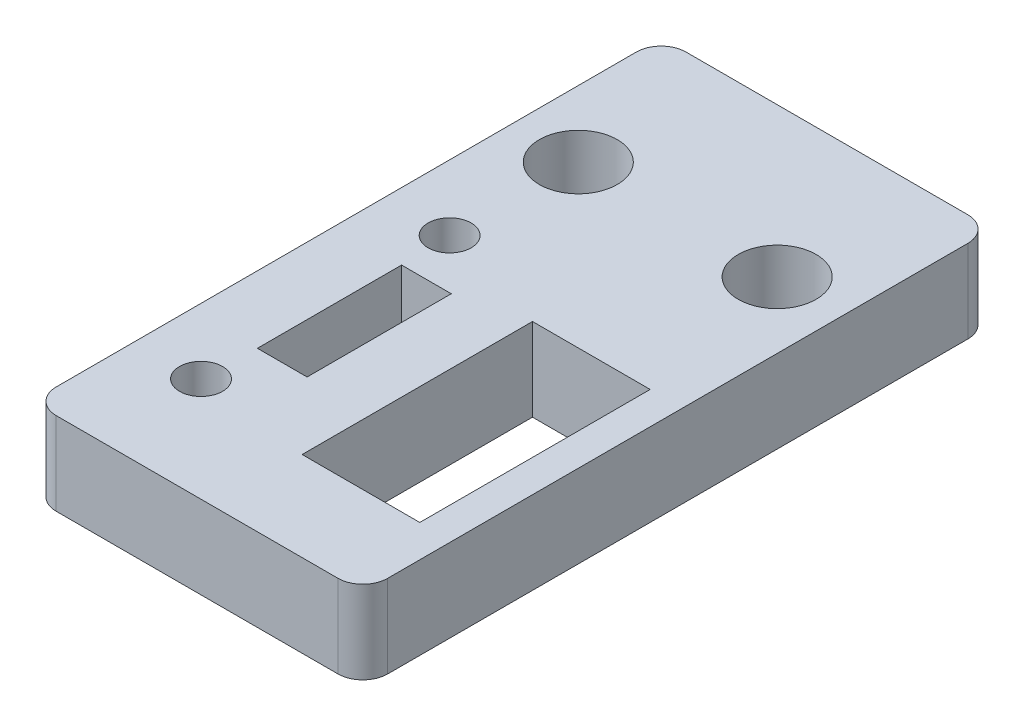
ISO-10303-21;
HEADER;
FILE_DESCRIPTION(('STEP AP214'),'2;1');
FILE_NAME('part.step','',(''),(''),'','','');
FILE_SCHEMA(('AUTOMOTIVE_DESIGN { 1 0 10303 214 1 1 1 1 }'));
ENDSEC;
DATA;
#1=APPLICATION_CONTEXT('core data for automotive mechanical design processes');
#2=APPLICATION_PROTOCOL_DEFINITION('international standard','automotive_design',2000,#1);
#3=PRODUCT_CONTEXT('',#1,'mechanical');
#4=PRODUCT('Part','Part','',(#3));
#5=PRODUCT_RELATED_PRODUCT_CATEGORY('part','',(#4));
#6=PRODUCT_DEFINITION_FORMATION('','',#4);
#7=PRODUCT_DEFINITION_CONTEXT('part definition',#1,'design');
#8=PRODUCT_DEFINITION('design','',#6,#7);
#9=PRODUCT_DEFINITION_SHAPE('','',#8);
#10=(LENGTH_UNIT() NAMED_UNIT(*) SI_UNIT(.MILLI.,.METRE.));
#11=(NAMED_UNIT(*) PLANE_ANGLE_UNIT() SI_UNIT($,.RADIAN.));
#12=(NAMED_UNIT(*) SI_UNIT($,.STERADIAN.) SOLID_ANGLE_UNIT());
#13=UNCERTAINTY_MEASURE_WITH_UNIT(LENGTH_MEASURE(1.E-05),#10,'distance_accuracy_value','');
#14=(GEOMETRIC_REPRESENTATION_CONTEXT(3) GLOBAL_UNCERTAINTY_ASSIGNED_CONTEXT((#13)) GLOBAL_UNIT_ASSIGNED_CONTEXT((#10,
#11,#12)) REPRESENTATION_CONTEXT('',''));
#15=CARTESIAN_POINT('',(0.,0.,0.));
#16=DIRECTION('',(0.,0.,1.));
#17=DIRECTION('',(1.,0.,0.));
#18=AXIS2_PLACEMENT_3D('',#15,#16,#17);
#19=CARTESIAN_POINT('',(-236.,67.49994211399,3.5));
#20=DIRECTION('',(0.,1.,0.));
#21=DIRECTION('',(0.,0.,1.));
#22=AXIS2_PLACEMENT_3D('',#19,#20,#21);
#23=PLANE('',#22);
#24=CARTESIAN_POINT('',(-230.,67.49994211399,-8.));
#25=DIRECTION('',(0.,1.,0.));
#26=DIRECTION('',(0.,0.,1.));
#27=AXIS2_PLACEMENT_3D('',#24,#25,#26);
#28=CIRCLE('',#27,2.35);
#29=CARTESIAN_POINT('',(-230.,67.49994211399,-5.65));
#30=VERTEX_POINT('',#29);
#31=EDGE_CURVE('E200',#30,#30,#28,.F.);
#32=ORIENTED_EDGE('',*,*,#31,.T.);
#33=EDGE_LOOP('',(#32));
#34=FACE_BOUND('',#33,.T.);
#35=CARTESIAN_POINT('',(-242.,67.49994211399,-8.));
#36=DIRECTION('',(0.,1.,0.));
#37=DIRECTION('',(0.,0.,1.));
#38=AXIS2_PLACEMENT_3D('',#35,#36,#37);
#39=CIRCLE('',#38,2.35);
#40=CARTESIAN_POINT('',(-242.,67.49994211399,-5.65));
#41=VERTEX_POINT('',#40);
#42=EDGE_CURVE('E196',#41,#41,#39,.F.);
#43=ORIENTED_EDGE('',*,*,#42,.T.);
#44=EDGE_LOOP('',(#43));
#45=FACE_BOUND('',#44,.T.);
#46=CARTESIAN_POINT('',(-227.5,67.49994211399,-15.5));
#47=DIRECTION('',(0.,-1.,0.));
#48=DIRECTION('',(0.,0.,-1.));
#49=AXIS2_PLACEMENT_3D('',#46,#47,#48);
#50=CIRCLE('',#49,1.5);
#51=CARTESIAN_POINT('',(-227.5,67.49994211399,-17.));
#52=VERTEX_POINT('',#51);
#53=CARTESIAN_POINT('',(-226.,67.49994211399,-15.5));
#54=VERTEX_POINT('',#53);
#55=EDGE_CURVE('E144',#52,#54,#50,.T.);
#56=ORIENTED_EDGE('',*,*,#55,.F.);
#57=DIRECTION('',(-1.,0.,0.));
#58=VECTOR('',#57,1.);
#59=CARTESIAN_POINT('',(-246.,67.49994211399,-17.));
#60=LINE('',#59,#58);
#61=CARTESIAN_POINT('',(-244.5,67.49994211399,-17.));
#62=VERTEX_POINT('',#61);
#63=EDGE_CURVE('E140',#62,#52,#60,.F.);
#64=ORIENTED_EDGE('',*,*,#63,.F.);
#65=CARTESIAN_POINT('',(-244.5,67.49994211399,-15.5));
#66=DIRECTION('',(0.,-1.,0.));
#67=DIRECTION('',(0.,0.,-1.));
#68=AXIS2_PLACEMENT_3D('',#65,#66,#67);
#69=CIRCLE('',#68,1.5);
#70=CARTESIAN_POINT('',(-246.,67.49994211399,-15.5));
#71=VERTEX_POINT('',#70);
#72=EDGE_CURVE('E19',#71,#62,#69,.T.);
#73=ORIENTED_EDGE('',*,*,#72,.F.);
#74=DIRECTION('',(0.,0.,1.));
#75=VECTOR('',#74,1.);
#76=CARTESIAN_POINT('',(-246.,67.49994211399,24.));
#77=LINE('',#76,#75);
#78=CARTESIAN_POINT('',(-246.,67.49994211399,19.5));
#79=VERTEX_POINT('',#78);
#80=EDGE_CURVE('E127',#79,#71,#77,.F.);
#81=ORIENTED_EDGE('',*,*,#80,.F.);
#82=CARTESIAN_POINT('',(-244.5,67.49994211399,19.5));
#83=DIRECTION('',(0.,-1.,0.));
#84=DIRECTION('',(0.,0.,-1.));
#85=AXIS2_PLACEMENT_3D('',#82,#83,#84);
#86=CIRCLE('',#85,1.5);
#87=CARTESIAN_POINT('',(-244.5,67.49994211399,21.));
#88=VERTEX_POINT('',#87);
#89=EDGE_CURVE('E207',#88,#79,#86,.T.);
#90=ORIENTED_EDGE('',*,*,#89,.F.);
#91=DIRECTION('',(1.,0.,0.));
#92=VECTOR('',#91,1.);
#93=CARTESIAN_POINT('',(-226.,67.49994211399,21.));
#94=LINE('',#93,#92);
#95=CARTESIAN_POINT('',(-227.5,67.49994211399,21.));
#96=VERTEX_POINT('',#95);
#97=EDGE_CURVE('E161',#96,#88,#94,.F.);
#98=ORIENTED_EDGE('',*,*,#97,.F.);
#99=CARTESIAN_POINT('',(-227.5,67.49994211399,19.5));
#100=DIRECTION('',(0.,-1.,0.));
#101=DIRECTION('',(0.,0.,-1.));
#102=AXIS2_PLACEMENT_3D('',#99,#100,#101);
#103=CIRCLE('',#102,1.5);
#104=CARTESIAN_POINT('',(-226.,67.49994211399,19.5));
#105=VERTEX_POINT('',#104);
#106=EDGE_CURVE('E206',#105,#96,#103,.T.);
#107=ORIENTED_EDGE('',*,*,#106,.F.);
#108=DIRECTION('',(0.,0.,-1.));
#109=VECTOR('',#108,1.);
#110=CARTESIAN_POINT('',(-226.,67.49994211399,-17.));
#111=LINE('',#110,#109);
#112=EDGE_CURVE('E157',#54,#105,#111,.F.);
#113=ORIENTED_EDGE('',*,*,#112,.F.);
#114=EDGE_LOOP('',(#56,#64,#73,#81,#90,#98,#107,#113));
#115=FACE_BOUND('',#114,.T.);
#116=CARTESIAN_POINT('',(-242.05,67.49994211399,14.7129502600828));
#117=DIRECTION('',(0.,1.,0.));
#118=DIRECTION('',(0.,0.,1.));
#119=AXIS2_PLACEMENT_3D('',#116,#117,#118);
#120=CIRCLE('',#119,1.3);
#121=CARTESIAN_POINT('',(-242.05,67.49994211399,16.0129502600828));
#122=VERTEX_POINT('',#121);
#123=EDGE_CURVE('E189',#122,#122,#120,.F.);
#124=ORIENTED_EDGE('',*,*,#123,.T.);
#125=EDGE_LOOP('',(#124));
#126=FACE_BOUND('',#125,.T.);
#127=CARTESIAN_POINT('',(-242.05,67.49994211399,-0.287049739917195));
#128=DIRECTION('',(0.,1.,0.));
#129=DIRECTION('',(0.,0.,1.));
#130=AXIS2_PLACEMENT_3D('',#127,#128,#129);
#131=CIRCLE('',#130,1.3);
#132=CARTESIAN_POINT('',(-242.05,67.49994211399,1.01295026008281));
#133=VERTEX_POINT('',#132);
#134=EDGE_CURVE('E192',#133,#133,#131,.F.);
#135=ORIENTED_EDGE('',*,*,#134,.T.);
#136=EDGE_LOOP('',(#135));
#137=FACE_BOUND('',#136,.T.);
#138=DIRECTION('',(0.,0.,-1.));
#139=VECTOR('',#138,1.);
#140=CARTESIAN_POINT('',(-238.95,67.49994211399,2.71295026008286));
#141=LINE('',#140,#139);
#142=CARTESIAN_POINT('',(-238.95,67.49994211399,2.71295026008286));
#143=VERTEX_POINT('',#142);
#144=CARTESIAN_POINT('',(-238.95,67.49994211399,11.4129502600829));
#145=VERTEX_POINT('',#144);
#146=EDGE_CURVE('E230',#143,#145,#141,.F.);
#147=ORIENTED_EDGE('',*,*,#146,.T.);
#148=DIRECTION('',(1.,0.,0.));
#149=VECTOR('',#148,1.);
#150=CARTESIAN_POINT('',(-238.95,67.49994211399,11.4129502600829));
#151=LINE('',#150,#149);
#152=CARTESIAN_POINT('',(-241.95,67.49994211399,11.4129502600829));
#153=VERTEX_POINT('',#152);
#154=EDGE_CURVE('E195',#145,#153,#151,.F.);
#155=ORIENTED_EDGE('',*,*,#154,.T.);
#156=DIRECTION('',(0.,0.,1.));
#157=VECTOR('',#156,1.);
#158=CARTESIAN_POINT('',(-241.95,67.49994211399,11.4129502600829));
#159=LINE('',#158,#157);
#160=CARTESIAN_POINT('',(-241.95,67.49994211399,2.71295026008286));
#161=VERTEX_POINT('',#160);
#162=EDGE_CURVE('E240',#153,#161,#159,.F.);
#163=ORIENTED_EDGE('',*,*,#162,.T.);
#164=DIRECTION('',(-1.,0.,0.));
#165=VECTOR('',#164,1.);
#166=CARTESIAN_POINT('',(-241.95,67.49994211399,2.71295026008286));
#167=LINE('',#166,#165);
#168=EDGE_CURVE('E235',#161,#143,#167,.F.);
#169=ORIENTED_EDGE('',*,*,#168,.T.);
#170=EDGE_LOOP('',(#147,#155,#163,#169));
#171=FACE_BOUND('',#170,.T.);
#172=DIRECTION('',(1.,0.,0.));
#173=VECTOR('',#172,1.);
#174=CARTESIAN_POINT('',(-229.95,67.49994211399,15.6129502600828));
#175=LINE('',#174,#173);
#176=CARTESIAN_POINT('',(-227.95,67.49994211399,15.6129502600828));
#177=VERTEX_POINT('',#176);
#178=CARTESIAN_POINT('',(-235.05,67.49994211399,15.6129502600828));
#179=VERTEX_POINT('',#178);
#180=EDGE_CURVE('E199',#177,#179,#175,.F.);
#181=ORIENTED_EDGE('',*,*,#180,.T.);
#182=DIRECTION('',(0.,0.,1.));
#183=VECTOR('',#182,1.);
#184=CARTESIAN_POINT('',(-235.05,67.49994211399,15.6129502600828));
#185=LINE('',#184,#183);
#186=CARTESIAN_POINT('',(-235.05,67.49994211399,1.71295026008287));
#187=VERTEX_POINT('',#186);
#188=EDGE_CURVE('E256',#179,#187,#185,.F.);
#189=ORIENTED_EDGE('',*,*,#188,.T.);
#190=DIRECTION('',(-1.,0.,0.));
#191=VECTOR('',#190,1.);
#192=CARTESIAN_POINT('',(-235.05,67.49994211399,1.71295026008287));
#193=LINE('',#192,#191);
#194=CARTESIAN_POINT('',(-227.95,67.49994211399,1.71295026008287));
#195=VERTEX_POINT('',#194);
#196=EDGE_CURVE('E251',#187,#195,#193,.F.);
#197=ORIENTED_EDGE('',*,*,#196,.T.);
#198=DIRECTION('',(0.,0.,-1.));
#199=VECTOR('',#198,1.);
#200=CARTESIAN_POINT('',(-227.95,67.49994211399,1.71295026008287));
#201=LINE('',#200,#199);
#202=EDGE_CURVE('E245',#195,#177,#201,.F.);
#203=ORIENTED_EDGE('',*,*,#202,.T.);
#204=EDGE_LOOP('',(#181,#189,#197,#203));
#205=FACE_BOUND('',#204,.T.);
#206=ADVANCED_FACE('F16',(#34,#45,#115,#126,#137,#171,#205),#23,.T.);
#207=CARTESIAN_POINT('',(-246.,62.49994211399,-17.));
#208=DIRECTION('',(0.,0.,-1.));
#209=DIRECTION('',(-1.,0.,0.));
#210=AXIS2_PLACEMENT_3D('',#207,#208,#209);
#211=PLANE('',#210);
#212=DIRECTION('',(0.,-1.,0.));
#213=VECTOR('',#212,1.);
#214=CARTESIAN_POINT('',(-227.5,74.01794211399,-17.));
#215=LINE('',#214,#213);
#216=CARTESIAN_POINT('',(-227.5,62.49994211399,-17.));
#217=VERTEX_POINT('',#216);
#218=EDGE_CURVE('E205',#217,#52,#215,.F.);
#219=ORIENTED_EDGE('',*,*,#218,.F.);
#220=DIRECTION('',(1.,0.,0.));
#221=VECTOR('',#220,1.);
#222=CARTESIAN_POINT('',(-236.,62.49994211399,-17.));
#223=LINE('',#222,#221);
#224=CARTESIAN_POINT('',(-244.5,62.49994211399,-17.));
#225=VERTEX_POINT('',#224);
#226=EDGE_CURVE('E151',#217,#225,#223,.F.);
#227=ORIENTED_EDGE('',*,*,#226,.T.);
#228=DIRECTION('',(0.,-1.,0.));
#229=VECTOR('',#228,1.);
#230=CARTESIAN_POINT('',(-244.5,74.01794211399,-17.));
#231=LINE('',#230,#229);
#232=EDGE_CURVE('E136',#62,#225,#231,.T.);
#233=ORIENTED_EDGE('',*,*,#232,.F.);
#234=ORIENTED_EDGE('',*,*,#63,.T.);
#235=EDGE_LOOP('',(#219,#227,#233,#234));
#236=FACE_BOUND('',#235,.T.);
#237=ADVANCED_FACE('F150',(#236),#211,.T.);
#238=CARTESIAN_POINT('',(-244.5,74.01794211399,-15.5));
#239=DIRECTION('',(0.,-1.,0.));
#240=DIRECTION('',(0.,0.,-1.));
#241=AXIS2_PLACEMENT_3D('',#238,#239,#240);
#242=CYLINDRICAL_SURFACE('',#241,1.5);
#243=ORIENTED_EDGE('',*,*,#72,.T.);
#244=ORIENTED_EDGE('',*,*,#232,.T.);
#245=CARTESIAN_POINT('',(-244.5,62.49994211399,-15.5));
#246=DIRECTION('',(0.,-1.,0.));
#247=DIRECTION('',(0.,0.,-1.));
#248=AXIS2_PLACEMENT_3D('',#245,#246,#247);
#249=CIRCLE('',#248,1.5);
#250=CARTESIAN_POINT('',(-246.,62.49994211399,-15.5));
#251=VERTEX_POINT('',#250);
#252=EDGE_CURVE('E187',#225,#251,#249,.F.);
#253=ORIENTED_EDGE('',*,*,#252,.T.);
#254=DIRECTION('',(0.,1.,0.));
#255=VECTOR('',#254,1.);
#256=CARTESIAN_POINT('',(-246.,62.49994211399,-15.5));
#257=LINE('',#256,#255);
#258=EDGE_CURVE('E138',#71,#251,#257,.F.);
#259=ORIENTED_EDGE('',*,*,#258,.F.);
#260=EDGE_LOOP('',(#243,#244,#253,#259));
#261=FACE_BOUND('',#260,.T.);
#262=ADVANCED_FACE('F133',(#261),#242,.T.);
#263=CARTESIAN_POINT('',(-246.,62.49994211399,24.));
#264=DIRECTION('',(-1.,0.,0.));
#265=DIRECTION('',(0.,0.,1.));
#266=AXIS2_PLACEMENT_3D('',#263,#264,#265);
#267=PLANE('',#266);
#268=ORIENTED_EDGE('',*,*,#80,.T.);
#269=ORIENTED_EDGE('',*,*,#258,.T.);
#270=DIRECTION('',(0.,0.,1.));
#271=VECTOR('',#270,1.);
#272=CARTESIAN_POINT('',(-246.,62.49994211399,3.5));
#273=LINE('',#272,#271);
#274=CARTESIAN_POINT('',(-246.,62.49994211399,19.5));
#275=VERTEX_POINT('',#274);
#276=EDGE_CURVE('E186',#251,#275,#273,.T.);
#277=ORIENTED_EDGE('',*,*,#276,.T.);
#278=DIRECTION('',(0.,-1.,0.));
#279=VECTOR('',#278,1.);
#280=CARTESIAN_POINT('',(-246.,74.01794211399,19.5));
#281=LINE('',#280,#279);
#282=EDGE_CURVE('E163',#79,#275,#281,.T.);
#283=ORIENTED_EDGE('',*,*,#282,.F.);
#284=EDGE_LOOP('',(#268,#269,#277,#283));
#285=FACE_BOUND('',#284,.T.);
#286=ADVANCED_FACE('F213',(#285),#267,.T.);
#287=CARTESIAN_POINT('',(-244.5,74.01794211399,19.5));
#288=DIRECTION('',(0.,-1.,0.));
#289=DIRECTION('',(0.,0.,-1.));
#290=AXIS2_PLACEMENT_3D('',#287,#288,#289);
#291=CYLINDRICAL_SURFACE('',#290,1.5);
#292=ORIENTED_EDGE('',*,*,#89,.T.);
#293=ORIENTED_EDGE('',*,*,#282,.T.);
#294=CARTESIAN_POINT('',(-244.5,62.49994211399,19.5));
#295=DIRECTION('',(0.,-1.,0.));
#296=DIRECTION('',(0.,0.,-1.));
#297=AXIS2_PLACEMENT_3D('',#294,#295,#296);
#298=CIRCLE('',#297,1.5);
#299=CARTESIAN_POINT('',(-244.5,62.49994211399,21.));
#300=VERTEX_POINT('',#299);
#301=EDGE_CURVE('E183',#275,#300,#298,.F.);
#302=ORIENTED_EDGE('',*,*,#301,.T.);
#303=DIRECTION('',(0.,1.,0.));
#304=VECTOR('',#303,1.);
#305=CARTESIAN_POINT('',(-244.5,62.49994211399,21.));
#306=LINE('',#305,#304);
#307=EDGE_CURVE('E162',#88,#300,#306,.F.);
#308=ORIENTED_EDGE('',*,*,#307,.F.);
#309=EDGE_LOOP('',(#292,#293,#302,#308));
#310=FACE_BOUND('',#309,.T.);
#311=ADVANCED_FACE('F272',(#310),#291,.T.);
#312=CARTESIAN_POINT('',(-226.,62.49994211399,21.));
#313=DIRECTION('',(0.,0.,1.));
#314=DIRECTION('',(1.,0.,0.));
#315=AXIS2_PLACEMENT_3D('',#312,#313,#314);
#316=PLANE('',#315);
#317=ORIENTED_EDGE('',*,*,#307,.T.);
#318=DIRECTION('',(1.,0.,0.));
#319=VECTOR('',#318,1.);
#320=CARTESIAN_POINT('',(-236.,62.49994211399,21.));
#321=LINE('',#320,#319);
#322=CARTESIAN_POINT('',(-227.5,62.49994211399,21.));
#323=VERTEX_POINT('',#322);
#324=EDGE_CURVE('E182',#300,#323,#321,.T.);
#325=ORIENTED_EDGE('',*,*,#324,.T.);
#326=DIRECTION('',(0.,-1.,0.));
#327=VECTOR('',#326,1.);
#328=CARTESIAN_POINT('',(-227.5,74.01794211399,21.));
#329=LINE('',#328,#327);
#330=EDGE_CURVE('E159',#96,#323,#329,.T.);
#331=ORIENTED_EDGE('',*,*,#330,.F.);
#332=ORIENTED_EDGE('',*,*,#97,.T.);
#333=EDGE_LOOP('',(#317,#325,#331,#332));
#334=FACE_BOUND('',#333,.T.);
#335=ADVANCED_FACE('F268',(#334),#316,.T.);
#336=CARTESIAN_POINT('',(-227.5,74.01794211399,19.5));
#337=DIRECTION('',(0.,-1.,0.));
#338=DIRECTION('',(0.,0.,-1.));
#339=AXIS2_PLACEMENT_3D('',#336,#337,#338);
#340=CYLINDRICAL_SURFACE('',#339,1.5);
#341=ORIENTED_EDGE('',*,*,#106,.T.);
#342=ORIENTED_EDGE('',*,*,#330,.T.);
#343=CARTESIAN_POINT('',(-227.5,62.49994211399,19.5));
#344=DIRECTION('',(0.,-1.,0.));
#345=DIRECTION('',(0.,0.,-1.));
#346=AXIS2_PLACEMENT_3D('',#343,#344,#345);
#347=CIRCLE('',#346,1.5);
#348=CARTESIAN_POINT('',(-226.,62.49994211399,19.5));
#349=VERTEX_POINT('',#348);
#350=EDGE_CURVE('E179',#323,#349,#347,.F.);
#351=ORIENTED_EDGE('',*,*,#350,.T.);
#352=DIRECTION('',(0.,1.,0.));
#353=VECTOR('',#352,1.);
#354=CARTESIAN_POINT('',(-226.,62.49994211399,19.5));
#355=LINE('',#354,#353);
#356=EDGE_CURVE('E158',#105,#349,#355,.F.);
#357=ORIENTED_EDGE('',*,*,#356,.F.);
#358=EDGE_LOOP('',(#341,#342,#351,#357));
#359=FACE_BOUND('',#358,.T.);
#360=ADVANCED_FACE('F280',(#359),#340,.T.);
#361=CARTESIAN_POINT('',(-226.,62.49994211399,-17.));
#362=DIRECTION('',(1.,0.,0.));
#363=DIRECTION('',(0.,0.,-1.));
#364=AXIS2_PLACEMENT_3D('',#361,#362,#363);
#365=PLANE('',#364);
#366=ORIENTED_EDGE('',*,*,#112,.T.);
#367=ORIENTED_EDGE('',*,*,#356,.T.);
#368=DIRECTION('',(0.,0.,1.));
#369=VECTOR('',#368,1.);
#370=CARTESIAN_POINT('',(-226.,62.49994211399,3.5));
#371=LINE('',#370,#369);
#372=CARTESIAN_POINT('',(-226.,62.49994211399,-15.5));
#373=VERTEX_POINT('',#372);
#374=EDGE_CURVE('E178',#349,#373,#371,.F.);
#375=ORIENTED_EDGE('',*,*,#374,.T.);
#376=DIRECTION('',(0.,-1.,0.));
#377=VECTOR('',#376,1.);
#378=CARTESIAN_POINT('',(-226.,74.01794211399,-15.5));
#379=LINE('',#378,#377);
#380=EDGE_CURVE('E203',#54,#373,#379,.T.);
#381=ORIENTED_EDGE('',*,*,#380,.F.);
#382=EDGE_LOOP('',(#366,#367,#375,#381));
#383=FACE_BOUND('',#382,.T.);
#384=ADVANCED_FACE('F341',(#383),#365,.T.);
#385=CARTESIAN_POINT('',(-227.5,74.01794211399,-15.5));
#386=DIRECTION('',(0.,-1.,0.));
#387=DIRECTION('',(0.,0.,-1.));
#388=AXIS2_PLACEMENT_3D('',#385,#386,#387);
#389=CYLINDRICAL_SURFACE('',#388,1.5);
#390=ORIENTED_EDGE('',*,*,#55,.T.);
#391=ORIENTED_EDGE('',*,*,#380,.T.);
#392=CARTESIAN_POINT('',(-227.5,62.49994211399,-15.5));
#393=DIRECTION('',(0.,-1.,0.));
#394=DIRECTION('',(0.,0.,-1.));
#395=AXIS2_PLACEMENT_3D('',#392,#393,#394);
#396=CIRCLE('',#395,1.5);
#397=EDGE_CURVE('E175',#373,#217,#396,.F.);
#398=ORIENTED_EDGE('',*,*,#397,.T.);
#399=ORIENTED_EDGE('',*,*,#218,.T.);
#400=EDGE_LOOP('',(#390,#391,#398,#399));
#401=FACE_BOUND('',#400,.T.);
#402=ADVANCED_FACE('F337',(#401),#389,.T.);
#403=CARTESIAN_POINT('',(-230.,67.49994211399,-8.));
#404=DIRECTION('',(0.,1.,0.));
#405=DIRECTION('',(0.,0.,1.));
#406=AXIS2_PLACEMENT_3D('',#403,#404,#405);
#407=CYLINDRICAL_SURFACE('',#406,2.35);
#408=CARTESIAN_POINT('',(-230.,62.49994211399,-8.));
#409=DIRECTION('',(0.,1.,0.));
#410=DIRECTION('',(0.,0.,1.));
#411=AXIS2_PLACEMENT_3D('',#408,#409,#410);
#412=CIRCLE('',#411,2.35);
#413=CARTESIAN_POINT('',(-230.,62.49994211399,-5.65));
#414=VERTEX_POINT('',#413);
#415=EDGE_CURVE('E172',#414,#414,#412,.F.);
#416=ORIENTED_EDGE('',*,*,#415,.T.);
#417=EDGE_LOOP('',(#416));
#418=FACE_BOUND('',#417,.T.);
#419=ORIENTED_EDGE('',*,*,#31,.F.);
#420=EDGE_LOOP('',(#419));
#421=FACE_BOUND('',#420,.T.);
#422=ADVANCED_FACE('F333',(#418,#421),#407,.F.);
#423=CARTESIAN_POINT('',(-242.,67.49994211399,-8.));
#424=DIRECTION('',(0.,1.,0.));
#425=DIRECTION('',(0.,0.,1.));
#426=AXIS2_PLACEMENT_3D('',#423,#424,#425);
#427=CYLINDRICAL_SURFACE('',#426,2.35);
#428=CARTESIAN_POINT('',(-242.,62.49994211399,-8.));
#429=DIRECTION('',(0.,1.,0.));
#430=DIRECTION('',(0.,0.,1.));
#431=AXIS2_PLACEMENT_3D('',#428,#429,#430);
#432=CIRCLE('',#431,2.35);
#433=CARTESIAN_POINT('',(-242.,62.49994211399,-5.65));
#434=VERTEX_POINT('',#433);
#435=EDGE_CURVE('E168',#434,#434,#432,.F.);
#436=ORIENTED_EDGE('',*,*,#435,.T.);
#437=EDGE_LOOP('',(#436));
#438=FACE_BOUND('',#437,.T.);
#439=ORIENTED_EDGE('',*,*,#42,.F.);
#440=EDGE_LOOP('',(#439));
#441=FACE_BOUND('',#440,.T.);
#442=ADVANCED_FACE('F329',(#438,#441),#427,.F.);
#443=CARTESIAN_POINT('',(-229.95,67.99994211399,15.6129502600828));
#444=DIRECTION('',(0.,0.,1.));
#445=DIRECTION('',(1.,0.,0.));
#446=AXIS2_PLACEMENT_3D('',#443,#444,#445);
#447=PLANE('',#446);
#448=DIRECTION('',(0.,1.,0.));
#449=VECTOR('',#448,1.);
#450=CARTESIAN_POINT('',(-227.95,57.49994211399,15.6129502600828));
#451=LINE('',#450,#449);
#452=CARTESIAN_POINT('',(-227.95,62.49994211399,15.6129502600828));
#453=VERTEX_POINT('',#452);
#454=EDGE_CURVE('E242',#177,#453,#451,.F.);
#455=ORIENTED_EDGE('',*,*,#454,.T.);
#456=DIRECTION('',(1.,0.,0.));
#457=VECTOR('',#456,1.);
#458=CARTESIAN_POINT('',(-236.,62.49994211399,15.6129502600828));
#459=LINE('',#458,#457);
#460=CARTESIAN_POINT('',(-235.05,62.49994211399,15.6129502600828));
#461=VERTEX_POINT('',#460);
#462=EDGE_CURVE('E171',#453,#461,#459,.F.);
#463=ORIENTED_EDGE('',*,*,#462,.T.);
#464=DIRECTION('',(0.,1.,0.));
#465=VECTOR('',#464,1.);
#466=CARTESIAN_POINT('',(-235.05,67.99994211399,15.6129502600828));
#467=LINE('',#466,#465);
#468=EDGE_CURVE('E258',#461,#179,#467,.T.);
#469=ORIENTED_EDGE('',*,*,#468,.T.);
#470=ORIENTED_EDGE('',*,*,#180,.F.);
#471=EDGE_LOOP('',(#455,#463,#469,#470));
#472=FACE_BOUND('',#471,.T.);
#473=ADVANCED_FACE('F325',(#472),#447,.F.);
#474=CARTESIAN_POINT('',(-235.05,67.99994211399,15.6129502600828));
#475=DIRECTION('',(-1.,0.,0.));
#476=DIRECTION('',(0.,0.,1.));
#477=AXIS2_PLACEMENT_3D('',#474,#475,#476);
#478=PLANE('',#477);
#479=ORIENTED_EDGE('',*,*,#468,.F.);
#480=DIRECTION('',(0.,0.,1.));
#481=VECTOR('',#480,1.);
#482=CARTESIAN_POINT('',(-235.05,62.49994211399,3.5));
#483=LINE('',#482,#481);
#484=CARTESIAN_POINT('',(-235.05,62.49994211399,1.71295026008287));
#485=VERTEX_POINT('',#484);
#486=EDGE_CURVE('E358',#461,#485,#483,.F.);
#487=ORIENTED_EDGE('',*,*,#486,.T.);
#488=DIRECTION('',(0.,1.,0.));
#489=VECTOR('',#488,1.);
#490=CARTESIAN_POINT('',(-235.05,67.99994211399,1.71295026008287));
#491=LINE('',#490,#489);
#492=EDGE_CURVE('E253',#485,#187,#491,.T.);
#493=ORIENTED_EDGE('',*,*,#492,.T.);
#494=ORIENTED_EDGE('',*,*,#188,.F.);
#495=EDGE_LOOP('',(#479,#487,#493,#494));
#496=FACE_BOUND('',#495,.T.);
#497=ADVANCED_FACE('F321',(#496),#478,.F.);
#498=CARTESIAN_POINT('',(-235.05,67.99994211399,1.71295026008287));
#499=DIRECTION('',(0.,0.,-1.));
#500=DIRECTION('',(-1.,0.,0.));
#501=AXIS2_PLACEMENT_3D('',#498,#499,#500);
#502=PLANE('',#501);
#503=ORIENTED_EDGE('',*,*,#492,.F.);
#504=DIRECTION('',(1.,0.,0.));
#505=VECTOR('',#504,1.);
#506=CARTESIAN_POINT('',(-236.,62.49994211399,1.71295026008287));
#507=LINE('',#506,#505);
#508=CARTESIAN_POINT('',(-227.95,62.49994211399,1.71295026008287));
#509=VERTEX_POINT('',#508);
#510=EDGE_CURVE('E361',#485,#509,#507,.T.);
#511=ORIENTED_EDGE('',*,*,#510,.T.);
#512=DIRECTION('',(0.,1.,0.));
#513=VECTOR('',#512,1.);
#514=CARTESIAN_POINT('',(-227.95,57.49994211399,1.71295026008287));
#515=LINE('',#514,#513);
#516=EDGE_CURVE('E248',#509,#195,#515,.T.);
#517=ORIENTED_EDGE('',*,*,#516,.T.);
#518=ORIENTED_EDGE('',*,*,#196,.F.);
#519=EDGE_LOOP('',(#503,#511,#517,#518));
#520=FACE_BOUND('',#519,.T.);
#521=ADVANCED_FACE('F317',(#520),#502,.F.);
#522=CARTESIAN_POINT('',(-227.95,57.49994211399,1.71295026008287));
#523=DIRECTION('',(1.,0.,0.));
#524=DIRECTION('',(0.,0.,-1.));
#525=AXIS2_PLACEMENT_3D('',#522,#523,#524);
#526=PLANE('',#525);
#527=ORIENTED_EDGE('',*,*,#202,.F.);
#528=ORIENTED_EDGE('',*,*,#516,.F.);
#529=DIRECTION('',(0.,0.,1.));
#530=VECTOR('',#529,1.);
#531=CARTESIAN_POINT('',(-227.95,62.49994211399,3.5));
#532=LINE('',#531,#530);
#533=EDGE_CURVE('E364',#509,#453,#532,.T.);
#534=ORIENTED_EDGE('',*,*,#533,.T.);
#535=ORIENTED_EDGE('',*,*,#454,.F.);
#536=EDGE_LOOP('',(#527,#528,#534,#535));
#537=FACE_BOUND('',#536,.T.);
#538=ADVANCED_FACE('F313',(#537),#526,.F.);
#539=CARTESIAN_POINT('',(-241.95,67.99994211399,11.4129502600829));
#540=DIRECTION('',(-1.,0.,0.));
#541=DIRECTION('',(0.,0.,1.));
#542=AXIS2_PLACEMENT_3D('',#539,#540,#541);
#543=PLANE('',#542);
#544=DIRECTION('',(0.,1.,0.));
#545=VECTOR('',#544,1.);
#546=CARTESIAN_POINT('',(-241.95,67.99994211399,11.4129502600829));
#547=LINE('',#546,#545);
#548=CARTESIAN_POINT('',(-241.95,62.49994211399,11.4129502600829));
#549=VERTEX_POINT('',#548);
#550=EDGE_CURVE('E227',#153,#549,#547,.F.);
#551=ORIENTED_EDGE('',*,*,#550,.T.);
#552=DIRECTION('',(0.,0.,1.));
#553=VECTOR('',#552,1.);
#554=CARTESIAN_POINT('',(-241.95,62.49994211399,3.5));
#555=LINE('',#554,#553);
#556=CARTESIAN_POINT('',(-241.95,62.49994211399,2.71295026008286));
#557=VERTEX_POINT('',#556);
#558=EDGE_CURVE('E367',#549,#557,#555,.F.);
#559=ORIENTED_EDGE('',*,*,#558,.T.);
#560=DIRECTION('',(0.,1.,0.));
#561=VECTOR('',#560,1.);
#562=CARTESIAN_POINT('',(-241.95,67.99994211399,2.71295026008286));
#563=LINE('',#562,#561);
#564=EDGE_CURVE('E237',#557,#161,#563,.T.);
#565=ORIENTED_EDGE('',*,*,#564,.T.);
#566=ORIENTED_EDGE('',*,*,#162,.F.);
#567=EDGE_LOOP('',(#551,#559,#565,#566));
#568=FACE_BOUND('',#567,.T.);
#569=ADVANCED_FACE('F309',(#568),#543,.F.);
#570=CARTESIAN_POINT('',(-241.95,67.99994211399,2.71295026008286));
#571=DIRECTION('',(0.,0.,-1.));
#572=DIRECTION('',(-1.,0.,0.));
#573=AXIS2_PLACEMENT_3D('',#570,#571,#572);
#574=PLANE('',#573);
#575=ORIENTED_EDGE('',*,*,#564,.F.);
#576=DIRECTION('',(1.,0.,0.));
#577=VECTOR('',#576,1.);
#578=CARTESIAN_POINT('',(-236.,62.49994211399,2.71295026008286));
#579=LINE('',#578,#577);
#580=CARTESIAN_POINT('',(-238.95,62.49994211399,2.71295026008286));
#581=VERTEX_POINT('',#580);
#582=EDGE_CURVE('E370',#557,#581,#579,.T.);
#583=ORIENTED_EDGE('',*,*,#582,.T.);
#584=DIRECTION('',(0.,1.,0.));
#585=VECTOR('',#584,1.);
#586=CARTESIAN_POINT('',(-238.95,67.99994211399,2.71295026008286));
#587=LINE('',#586,#585);
#588=EDGE_CURVE('E232',#581,#143,#587,.T.);
#589=ORIENTED_EDGE('',*,*,#588,.T.);
#590=ORIENTED_EDGE('',*,*,#168,.F.);
#591=EDGE_LOOP('',(#575,#583,#589,#590));
#592=FACE_BOUND('',#591,.T.);
#593=ADVANCED_FACE('F305',(#592),#574,.F.);
#594=CARTESIAN_POINT('',(-238.95,67.99994211399,2.71295026008286));
#595=DIRECTION('',(1.,0.,0.));
#596=DIRECTION('',(0.,0.,-1.));
#597=AXIS2_PLACEMENT_3D('',#594,#595,#596);
#598=PLANE('',#597);
#599=ORIENTED_EDGE('',*,*,#588,.F.);
#600=DIRECTION('',(0.,0.,1.));
#601=VECTOR('',#600,1.);
#602=CARTESIAN_POINT('',(-238.95,62.49994211399,3.5));
#603=LINE('',#602,#601);
#604=CARTESIAN_POINT('',(-238.95,62.49994211399,11.4129502600829));
#605=VERTEX_POINT('',#604);
#606=EDGE_CURVE('E373',#581,#605,#603,.T.);
#607=ORIENTED_EDGE('',*,*,#606,.T.);
#608=DIRECTION('',(0.,1.,0.));
#609=VECTOR('',#608,1.);
#610=CARTESIAN_POINT('',(-238.95,67.99994211399,11.4129502600829));
#611=LINE('',#610,#609);
#612=EDGE_CURVE('E34',#605,#145,#611,.T.);
#613=ORIENTED_EDGE('',*,*,#612,.T.);
#614=ORIENTED_EDGE('',*,*,#146,.F.);
#615=EDGE_LOOP('',(#599,#607,#613,#614));
#616=FACE_BOUND('',#615,.T.);
#617=ADVANCED_FACE('F302',(#616),#598,.F.);
#618=CARTESIAN_POINT('',(-238.95,67.99994211399,11.4129502600829));
#619=DIRECTION('',(0.,0.,1.));
#620=DIRECTION('',(1.,0.,0.));
#621=AXIS2_PLACEMENT_3D('',#618,#619,#620);
#622=PLANE('',#621);
#623=ORIENTED_EDGE('',*,*,#612,.F.);
#624=DIRECTION('',(1.,0.,0.));
#625=VECTOR('',#624,1.);
#626=CARTESIAN_POINT('',(-236.,62.49994211399,11.4129502600829));
#627=LINE('',#626,#625);
#628=EDGE_CURVE('E167',#605,#549,#627,.F.);
#629=ORIENTED_EDGE('',*,*,#628,.T.);
#630=ORIENTED_EDGE('',*,*,#550,.F.);
#631=ORIENTED_EDGE('',*,*,#154,.F.);
#632=EDGE_LOOP('',(#623,#629,#630,#631));
#633=FACE_BOUND('',#632,.T.);
#634=ADVANCED_FACE('F298',(#633),#622,.F.);
#635=CARTESIAN_POINT('',(-242.05,61.99994211399,-0.287049739917195));
#636=DIRECTION('',(0.,1.,0.));
#637=DIRECTION('',(0.,0.,1.));
#638=AXIS2_PLACEMENT_3D('',#635,#636,#637);
#639=CYLINDRICAL_SURFACE('',#638,1.3);
#640=CARTESIAN_POINT('',(-242.05,62.49994211399,-0.287049739917195));
#641=DIRECTION('',(0.,1.,0.));
#642=DIRECTION('',(0.,0.,1.));
#643=AXIS2_PLACEMENT_3D('',#640,#641,#642);
#644=CIRCLE('',#643,1.3);
#645=CARTESIAN_POINT('',(-242.05,62.49994211399,1.01295026008281));
#646=VERTEX_POINT('',#645);
#647=EDGE_CURVE('E25',#646,#646,#644,.F.);
#648=ORIENTED_EDGE('',*,*,#647,.T.);
#649=EDGE_LOOP('',(#648));
#650=FACE_BOUND('',#649,.T.);
#651=ORIENTED_EDGE('',*,*,#134,.F.);
#652=EDGE_LOOP('',(#651));
#653=FACE_BOUND('',#652,.T.);
#654=ADVANCED_FACE('F290',(#650,#653),#639,.F.);
#655=CARTESIAN_POINT('',(-242.05,61.99994211399,14.7129502600828));
#656=DIRECTION('',(0.,1.,0.));
#657=DIRECTION('',(0.,0.,1.));
#658=AXIS2_PLACEMENT_3D('',#655,#656,#657);
#659=CYLINDRICAL_SURFACE('',#658,1.3);
#660=CARTESIAN_POINT('',(-242.05,62.49994211399,14.7129502600828));
#661=DIRECTION('',(0.,1.,0.));
#662=DIRECTION('',(0.,0.,1.));
#663=AXIS2_PLACEMENT_3D('',#660,#661,#662);
#664=CIRCLE('',#663,1.3);
#665=CARTESIAN_POINT('',(-242.05,62.49994211399,16.0129502600828));
#666=VERTEX_POINT('',#665);
#667=EDGE_CURVE('E11',#666,#666,#664,.F.);
#668=ORIENTED_EDGE('',*,*,#667,.T.);
#669=EDGE_LOOP('',(#668));
#670=FACE_BOUND('',#669,.T.);
#671=ORIENTED_EDGE('',*,*,#123,.F.);
#672=EDGE_LOOP('',(#671));
#673=FACE_BOUND('',#672,.T.);
#674=ADVANCED_FACE('F284',(#670,#673),#659,.F.);
#675=CARTESIAN_POINT('',(-236.,62.49994211399,3.5));
#676=DIRECTION('',(0.,1.,0.));
#677=DIRECTION('',(0.,0.,1.));
#678=AXIS2_PLACEMENT_3D('',#675,#676,#677);
#679=PLANE('',#678);
#680=ORIENTED_EDGE('',*,*,#667,.F.);
#681=EDGE_LOOP('',(#680));
#682=FACE_BOUND('',#681,.T.);
#683=ORIENTED_EDGE('',*,*,#647,.F.);
#684=EDGE_LOOP('',(#683));
#685=FACE_BOUND('',#684,.T.);
#686=ORIENTED_EDGE('',*,*,#606,.F.);
#687=ORIENTED_EDGE('',*,*,#582,.F.);
#688=ORIENTED_EDGE('',*,*,#558,.F.);
#689=ORIENTED_EDGE('',*,*,#628,.F.);
#690=EDGE_LOOP('',(#686,#687,#688,#689));
#691=FACE_BOUND('',#690,.T.);
#692=ORIENTED_EDGE('',*,*,#510,.F.);
#693=ORIENTED_EDGE('',*,*,#486,.F.);
#694=ORIENTED_EDGE('',*,*,#462,.F.);
#695=ORIENTED_EDGE('',*,*,#533,.F.);
#696=EDGE_LOOP('',(#692,#693,#694,#695));
#697=FACE_BOUND('',#696,.T.);
#698=ORIENTED_EDGE('',*,*,#435,.F.);
#699=EDGE_LOOP('',(#698));
#700=FACE_BOUND('',#699,.T.);
#701=ORIENTED_EDGE('',*,*,#415,.F.);
#702=EDGE_LOOP('',(#701));
#703=FACE_BOUND('',#702,.T.);
#704=ORIENTED_EDGE('',*,*,#374,.F.);
#705=ORIENTED_EDGE('',*,*,#350,.F.);
#706=ORIENTED_EDGE('',*,*,#324,.F.);
#707=ORIENTED_EDGE('',*,*,#301,.F.);
#708=ORIENTED_EDGE('',*,*,#276,.F.);
#709=ORIENTED_EDGE('',*,*,#252,.F.);
#710=ORIENTED_EDGE('',*,*,#226,.F.);
#711=ORIENTED_EDGE('',*,*,#397,.F.);
#712=EDGE_LOOP('',(#704,#705,#706,#707,#708,#709,#710,#711));
#713=FACE_BOUND('',#712,.T.);
#714=ADVANCED_FACE('F217',(#682,#685,#691,#697,#700,#703,#713),#679,.F.);
#715=CLOSED_SHELL('',(#206,#237,#262,#286,#311,#335,#360,#384,#402,#422,#442,#473,#497,#521,
#538,#569,#593,#617,#634,#654,#674,#714));
#716=MANIFOLD_SOLID_BREP('B1',#715);
#717=ADVANCED_BREP_SHAPE_REPRESENTATION('',(#18,#716),#14);
#718=SHAPE_DEFINITION_REPRESENTATION(#9,#717);
ENDSEC;
END-ISO-10303-21;
